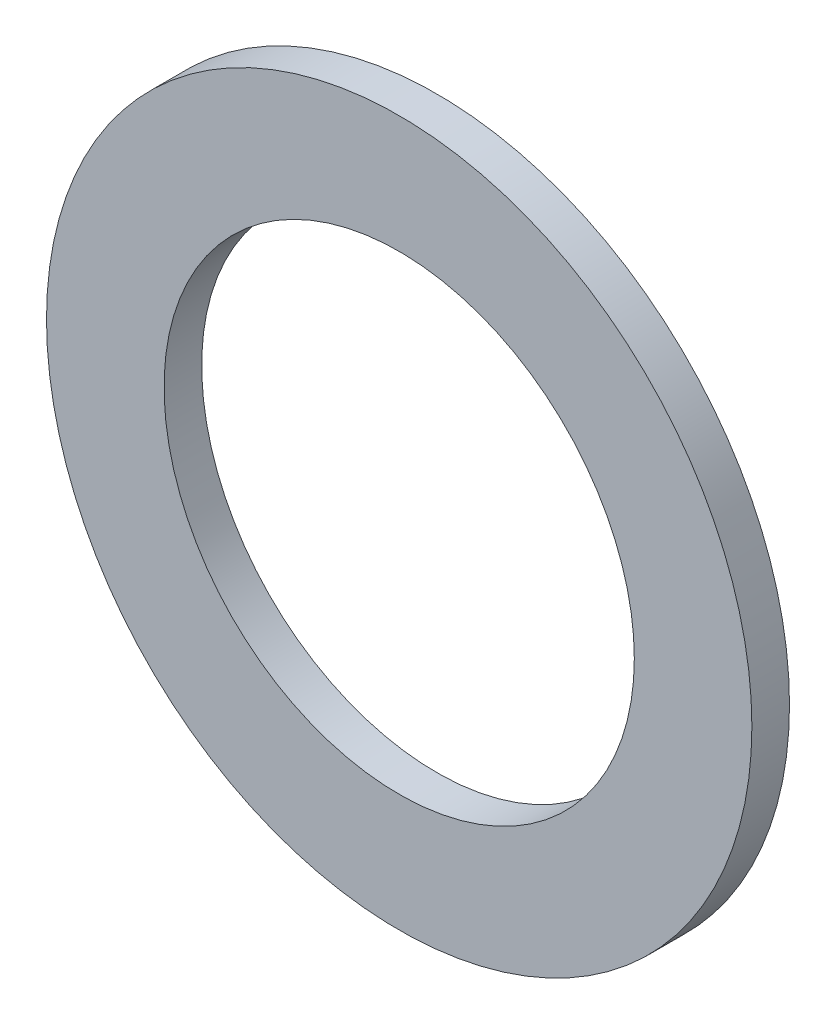
ISO-10303-21;
HEADER;
FILE_DESCRIPTION(('STEP AP214'),'2;1');
FILE_NAME('part.step','',(''),(''),'','','');
FILE_SCHEMA(('AUTOMOTIVE_DESIGN { 1 0 10303 214 1 1 1 1 }'));
ENDSEC;
DATA;
#1=APPLICATION_CONTEXT('core data for automotive mechanical design processes');
#2=APPLICATION_PROTOCOL_DEFINITION('international standard','automotive_design',2000,#1);
#3=PRODUCT_CONTEXT('',#1,'mechanical');
#4=PRODUCT('Part','Part','',(#3));
#5=PRODUCT_RELATED_PRODUCT_CATEGORY('part','',(#4));
#6=PRODUCT_DEFINITION_FORMATION('','',#4);
#7=PRODUCT_DEFINITION_CONTEXT('part definition',#1,'design');
#8=PRODUCT_DEFINITION('design','',#6,#7);
#9=PRODUCT_DEFINITION_SHAPE('','',#8);
#10=(LENGTH_UNIT() NAMED_UNIT(*) SI_UNIT(.MILLI.,.METRE.));
#11=(NAMED_UNIT(*) PLANE_ANGLE_UNIT() SI_UNIT($,.RADIAN.));
#12=(NAMED_UNIT(*) SI_UNIT($,.STERADIAN.) SOLID_ANGLE_UNIT());
#13=UNCERTAINTY_MEASURE_WITH_UNIT(LENGTH_MEASURE(1.E-05),#10,'distance_accuracy_value','');
#14=(GEOMETRIC_REPRESENTATION_CONTEXT(3) GLOBAL_UNCERTAINTY_ASSIGNED_CONTEXT((#13)) GLOBAL_UNIT_ASSIGNED_CONTEXT((#10,
#11,#12)) REPRESENTATION_CONTEXT('',''));
#15=CARTESIAN_POINT('',(0.,0.,0.));
#16=DIRECTION('',(0.,0.,1.));
#17=DIRECTION('',(1.,0.,0.));
#18=AXIS2_PLACEMENT_3D('',#15,#16,#17);
#19=CARTESIAN_POINT('',(0.,0.,0.127));
#20=DIRECTION('',(0.,0.,1.));
#21=DIRECTION('',(1.,0.,0.));
#22=AXIS2_PLACEMENT_3D('',#19,#20,#21);
#23=PLANE('',#22);
#24=CARTESIAN_POINT('',(0.,0.,0.127));
#25=DIRECTION('',(0.,0.,1.));
#26=DIRECTION('',(1.,0.,0.));
#27=AXIS2_PLACEMENT_3D('',#24,#25,#26);
#28=CIRCLE('',#27,2.38125);
#29=CARTESIAN_POINT('',(2.38125,0.,0.127));
#30=VERTEX_POINT('',#29);
#31=EDGE_CURVE('E10',#30,#30,#28,.T.);
#32=ORIENTED_EDGE('',*,*,#31,.T.);
#33=EDGE_LOOP('',(#32));
#34=FACE_BOUND('',#33,.T.);
#35=CARTESIAN_POINT('',(0.,0.,0.127));
#36=DIRECTION('',(0.,0.,1.));
#37=DIRECTION('',(1.,0.,0.));
#38=AXIS2_PLACEMENT_3D('',#35,#36,#37);
#39=CIRCLE('',#38,1.5875);
#40=CARTESIAN_POINT('',(1.5875,0.,0.127));
#41=VERTEX_POINT('',#40);
#42=EDGE_CURVE('E43',#41,#41,#39,.T.);
#43=ORIENTED_EDGE('',*,*,#42,.F.);
#44=EDGE_LOOP('',(#43));
#45=FACE_BOUND('',#44,.T.);
#46=ADVANCED_FACE('F32',(#34,#45),#23,.T.);
#47=CARTESIAN_POINT('',(0.,0.,-0.127));
#48=DIRECTION('',(0.,0.,1.));
#49=DIRECTION('',(1.,0.,0.));
#50=AXIS2_PLACEMENT_3D('',#47,#48,#49);
#51=PLANE('',#50);
#52=CARTESIAN_POINT('',(0.,0.,-0.127));
#53=DIRECTION('',(0.,0.,1.));
#54=DIRECTION('',(1.,0.,0.));
#55=AXIS2_PLACEMENT_3D('',#52,#53,#54);
#56=CIRCLE('',#55,2.38125);
#57=CARTESIAN_POINT('',(2.38125,0.,-0.127));
#58=VERTEX_POINT('',#57);
#59=EDGE_CURVE('E36',#58,#58,#56,.T.);
#60=ORIENTED_EDGE('',*,*,#59,.F.);
#61=EDGE_LOOP('',(#60));
#62=FACE_BOUND('',#61,.T.);
#63=CARTESIAN_POINT('',(0.,0.,-0.127));
#64=DIRECTION('',(0.,0.,1.));
#65=DIRECTION('',(1.,0.,0.));
#66=AXIS2_PLACEMENT_3D('',#63,#64,#65);
#67=CIRCLE('',#66,1.5875);
#68=CARTESIAN_POINT('',(1.5875,0.,-0.127));
#69=VERTEX_POINT('',#68);
#70=EDGE_CURVE('E45',#69,#69,#67,.T.);
#71=ORIENTED_EDGE('',*,*,#70,.T.);
#72=EDGE_LOOP('',(#71));
#73=FACE_BOUND('',#72,.T.);
#74=ADVANCED_FACE('F55',(#62,#73),#51,.F.);
#75=CARTESIAN_POINT('',(0.,0.,0.127));
#76=DIRECTION('',(0.,0.,-1.));
#77=DIRECTION('',(-1.,0.,0.));
#78=AXIS2_PLACEMENT_3D('',#75,#76,#77);
#79=CYLINDRICAL_SURFACE('',#78,2.38125);
#80=ORIENTED_EDGE('',*,*,#31,.F.);
#81=EDGE_LOOP('',(#80));
#82=FACE_BOUND('',#81,.T.);
#83=ORIENTED_EDGE('',*,*,#59,.T.);
#84=EDGE_LOOP('',(#83));
#85=FACE_BOUND('',#84,.T.);
#86=ADVANCED_FACE('F34',(#82,#85),#79,.T.);
#87=CARTESIAN_POINT('',(0.,0.,0.127));
#88=DIRECTION('',(0.,0.,-1.));
#89=DIRECTION('',(-1.,0.,0.));
#90=AXIS2_PLACEMENT_3D('',#87,#88,#89);
#91=CYLINDRICAL_SURFACE('',#90,1.5875);
#92=ORIENTED_EDGE('',*,*,#42,.T.);
#93=EDGE_LOOP('',(#92));
#94=FACE_BOUND('',#93,.T.);
#95=ORIENTED_EDGE('',*,*,#70,.F.);
#96=EDGE_LOOP('',(#95));
#97=FACE_BOUND('',#96,.T.);
#98=ADVANCED_FACE('F51',(#94,#97),#91,.F.);
#99=CLOSED_SHELL('',(#46,#74,#86,#98));
#100=MANIFOLD_SOLID_BREP('B2',#99);
#101=ADVANCED_BREP_SHAPE_REPRESENTATION('',(#18,#100),#14);
#102=SHAPE_DEFINITION_REPRESENTATION(#9,#101);
ENDSEC;
END-ISO-10303-21;
